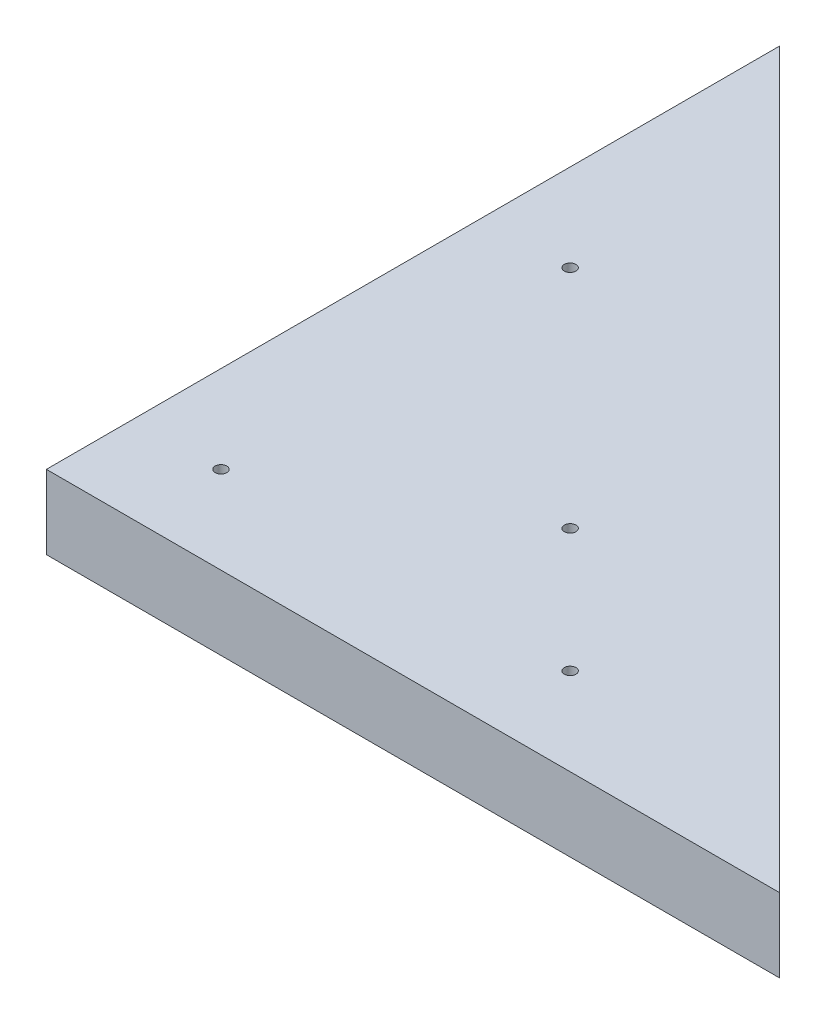
ISO-10303-21;
HEADER;
FILE_DESCRIPTION(('STEP AP214'),'2;1');
FILE_NAME('part.step','',(''),(''),'','','');
FILE_SCHEMA(('AUTOMOTIVE_DESIGN { 1 0 10303 214 1 1 1 1 }'));
ENDSEC;
DATA;
#1=APPLICATION_CONTEXT('core data for automotive mechanical design processes');
#2=APPLICATION_PROTOCOL_DEFINITION('international standard','automotive_design',2000,#1);
#3=PRODUCT_CONTEXT('',#1,'mechanical');
#4=PRODUCT('Part','Part','',(#3));
#5=PRODUCT_RELATED_PRODUCT_CATEGORY('part','',(#4));
#6=PRODUCT_DEFINITION_FORMATION('','',#4);
#7=PRODUCT_DEFINITION_CONTEXT('part definition',#1,'design');
#8=PRODUCT_DEFINITION('design','',#6,#7);
#9=PRODUCT_DEFINITION_SHAPE('','',#8);
#10=(LENGTH_UNIT() NAMED_UNIT(*) SI_UNIT(.MILLI.,.METRE.));
#11=(NAMED_UNIT(*) PLANE_ANGLE_UNIT() SI_UNIT($,.RADIAN.));
#12=(NAMED_UNIT(*) SI_UNIT($,.STERADIAN.) SOLID_ANGLE_UNIT());
#13=UNCERTAINTY_MEASURE_WITH_UNIT(LENGTH_MEASURE(1.E-05),#10,'distance_accuracy_value','');
#14=(GEOMETRIC_REPRESENTATION_CONTEXT(3) GLOBAL_UNCERTAINTY_ASSIGNED_CONTEXT((#13)) GLOBAL_UNIT_ASSIGNED_CONTEXT((#10,
#11,#12)) REPRESENTATION_CONTEXT('',''));
#15=CARTESIAN_POINT('',(0.,0.,0.));
#16=DIRECTION('',(0.,0.,1.));
#17=DIRECTION('',(1.,0.,0.));
#18=AXIS2_PLACEMENT_3D('',#15,#16,#17);
#19=CARTESIAN_POINT('',(8.78679656440357,190.89090885901,8.78679656440358));
#20=DIRECTION('',(0.,-1.,0.));
#21=DIRECTION('',(0.,0.,-1.));
#22=AXIS2_PLACEMENT_3D('',#19,#20,#21);
#23=CYLINDRICAL_SURFACE('',#22,1.);
#24=CARTESIAN_POINT('',(8.78679656440357,0.,8.78679656440358));
#25=DIRECTION('',(0.,1.,0.));
#26=DIRECTION('',(0.,0.,1.));
#27=AXIS2_PLACEMENT_3D('',#24,#25,#26);
#28=CIRCLE('',#27,1.);
#29=CARTESIAN_POINT('',(8.78679656440357,0.,9.78679656440358));
#30=VERTEX_POINT('',#29);
#31=EDGE_CURVE('E95',#30,#30,#28,.T.);
#32=ORIENTED_EDGE('',*,*,#31,.F.);
#33=EDGE_LOOP('',(#32));
#34=FACE_BOUND('',#33,.T.);
#35=CARTESIAN_POINT('',(8.78679656440357,12.7,8.78679656440358));
#36=DIRECTION('',(0.,1.,0.));
#37=DIRECTION('',(0.,0.,1.));
#38=AXIS2_PLACEMENT_3D('',#35,#36,#37);
#39=CIRCLE('',#38,1.);
#40=CARTESIAN_POINT('',(8.78679656440357,12.7,9.78679656440358));
#41=VERTEX_POINT('',#40);
#42=EDGE_CURVE('E86',#41,#41,#39,.T.);
#43=ORIENTED_EDGE('',*,*,#42,.T.);
#44=EDGE_LOOP('',(#43));
#45=FACE_BOUND('',#44,.T.);
#46=ADVANCED_FACE('F33',(#34,#45),#23,.F.);
#47=CARTESIAN_POINT('',(-45.,190.89090885901,45.));
#48=DIRECTION('',(0.,0.,-1.));
#49=DIRECTION('',(-1.,0.,0.));
#50=AXIS2_PLACEMENT_3D('',#47,#48,#49);
#51=PLANE('',#50);
#52=DIRECTION('',(1.,0.,0.));
#53=VECTOR('',#52,1.);
#54=CARTESIAN_POINT('',(-45.,12.7,45.));
#55=LINE('',#54,#53);
#56=CARTESIAN_POINT('',(-45.,12.7,45.));
#57=VERTEX_POINT('',#56);
#58=CARTESIAN_POINT('',(81.,12.7,45.));
#59=VERTEX_POINT('',#58);
#60=EDGE_CURVE('E69',#57,#59,#55,.T.);
#61=ORIENTED_EDGE('',*,*,#60,.F.);
#62=DIRECTION('',(0.,-1.,0.));
#63=VECTOR('',#62,1.);
#64=CARTESIAN_POINT('',(-45.,190.89090885901,45.));
#65=LINE('',#64,#63);
#66=CARTESIAN_POINT('',(-45.,0.,45.));
#67=VERTEX_POINT('',#66);
#68=EDGE_CURVE('E42',#57,#67,#65,.T.);
#69=ORIENTED_EDGE('',*,*,#68,.T.);
#70=DIRECTION('',(1.,0.,0.));
#71=VECTOR('',#70,1.);
#72=CARTESIAN_POINT('',(-45.,0.,45.));
#73=LINE('',#72,#71);
#74=CARTESIAN_POINT('',(81.,0.,45.));
#75=VERTEX_POINT('',#74);
#76=EDGE_CURVE('E71',#67,#75,#73,.T.);
#77=ORIENTED_EDGE('',*,*,#76,.T.);
#78=DIRECTION('',(0.,-1.,0.));
#79=VECTOR('',#78,1.);
#80=CARTESIAN_POINT('',(81.,190.89090885901,45.));
#81=LINE('',#80,#79);
#82=EDGE_CURVE('E65',#59,#75,#81,.T.);
#83=ORIENTED_EDGE('',*,*,#82,.F.);
#84=EDGE_LOOP('',(#61,#69,#77,#83));
#85=FACE_BOUND('',#84,.T.);
#86=ADVANCED_FACE('F67',(#85),#51,.F.);
#87=CARTESIAN_POINT('',(-45.,190.89090885901,-81.));
#88=DIRECTION('',(1.,0.,0.));
#89=DIRECTION('',(0.,0.,-1.));
#90=AXIS2_PLACEMENT_3D('',#87,#88,#89);
#91=PLANE('',#90);
#92=DIRECTION('',(0.,0.,1.));
#93=VECTOR('',#92,1.);
#94=CARTESIAN_POINT('',(-45.,12.7,-81.));
#95=LINE('',#94,#93);
#96=CARTESIAN_POINT('',(-45.,12.7,-81.));
#97=VERTEX_POINT('',#96);
#98=EDGE_CURVE('E52',#97,#57,#95,.T.);
#99=ORIENTED_EDGE('',*,*,#98,.F.);
#100=DIRECTION('',(0.,-1.,0.));
#101=VECTOR('',#100,1.);
#102=CARTESIAN_POINT('',(-45.,190.89090885901,-81.));
#103=LINE('',#102,#101);
#104=CARTESIAN_POINT('',(-45.,0.,-81.));
#105=VERTEX_POINT('',#104);
#106=EDGE_CURVE('E11',#97,#105,#103,.T.);
#107=ORIENTED_EDGE('',*,*,#106,.T.);
#108=DIRECTION('',(0.,0.,1.));
#109=VECTOR('',#108,1.);
#110=CARTESIAN_POINT('',(-45.,0.,-81.));
#111=LINE('',#110,#109);
#112=EDGE_CURVE('E103',#105,#67,#111,.T.);
#113=ORIENTED_EDGE('',*,*,#112,.T.);
#114=ORIENTED_EDGE('',*,*,#68,.F.);
#115=EDGE_LOOP('',(#99,#107,#113,#114));
#116=FACE_BOUND('',#115,.T.);
#117=ADVANCED_FACE('F107',(#116),#91,.F.);
#118=CARTESIAN_POINT('',(81.,190.89090885901,45.));
#119=DIRECTION('',(-0.707106781186548,0.,0.707106781186548));
#120=DIRECTION('',(0.707106781186548,0.,0.707106781186548));
#121=AXIS2_PLACEMENT_3D('',#118,#119,#120);
#122=PLANE('',#121);
#123=DIRECTION('',(-0.707106781186548,0.,-0.707106781186548));
#124=VECTOR('',#123,1.);
#125=CARTESIAN_POINT('',(81.,12.7,45.));
#126=LINE('',#125,#124);
#127=EDGE_CURVE('E77',#59,#97,#126,.T.);
#128=ORIENTED_EDGE('',*,*,#127,.F.);
#129=ORIENTED_EDGE('',*,*,#82,.T.);
#130=DIRECTION('',(-0.707106781186547,0.,-0.707106781186547));
#131=VECTOR('',#130,1.);
#132=CARTESIAN_POINT('',(81.,0.,45.));
#133=LINE('',#132,#131);
#134=EDGE_CURVE('E101',#75,#105,#133,.T.);
#135=ORIENTED_EDGE('',*,*,#134,.T.);
#136=ORIENTED_EDGE('',*,*,#106,.F.);
#137=EDGE_LOOP('',(#128,#129,#135,#136));
#138=FACE_BOUND('',#137,.T.);
#139=ADVANCED_FACE('F35',(#138),#122,.F.);
#140=CARTESIAN_POINT('',(30.,190.89090885901,30.));
#141=DIRECTION('',(0.,-1.,0.));
#142=DIRECTION('',(0.,0.,-1.));
#143=AXIS2_PLACEMENT_3D('',#140,#141,#142);
#144=CYLINDRICAL_SURFACE('',#143,0.999999999999998);
#145=CARTESIAN_POINT('',(30.,0.,30.));
#146=DIRECTION('',(0.,1.,0.));
#147=DIRECTION('',(0.,0.,1.));
#148=AXIS2_PLACEMENT_3D('',#145,#146,#147);
#149=CIRCLE('',#148,0.999999999999998);
#150=CARTESIAN_POINT('',(30.,0.,31.));
#151=VERTEX_POINT('',#150);
#152=EDGE_CURVE('E98',#151,#151,#149,.T.);
#153=ORIENTED_EDGE('',*,*,#152,.F.);
#154=EDGE_LOOP('',(#153));
#155=FACE_BOUND('',#154,.T.);
#156=CARTESIAN_POINT('',(30.,12.7,30.));
#157=DIRECTION('',(0.,1.,0.));
#158=DIRECTION('',(0.,0.,1.));
#159=AXIS2_PLACEMENT_3D('',#156,#157,#158);
#160=CIRCLE('',#159,0.999999999999998);
#161=CARTESIAN_POINT('',(30.,12.7,31.));
#162=VERTEX_POINT('',#161);
#163=EDGE_CURVE('E82',#162,#162,#160,.T.);
#164=ORIENTED_EDGE('',*,*,#163,.T.);
#165=EDGE_LOOP('',(#164));
#166=FACE_BOUND('',#165,.T.);
#167=ADVANCED_FACE('F140',(#155,#166),#144,.F.);
#168=CARTESIAN_POINT('',(-30.,190.89090885901,-30.));
#169=DIRECTION('',(0.,-1.,0.));
#170=DIRECTION('',(0.,0.,-1.));
#171=AXIS2_PLACEMENT_3D('',#168,#169,#170);
#172=CYLINDRICAL_SURFACE('',#171,0.999999999999998);
#173=CARTESIAN_POINT('',(-30.,0.,-30.));
#174=DIRECTION('',(0.,1.,0.));
#175=DIRECTION('',(0.,0.,1.));
#176=AXIS2_PLACEMENT_3D('',#173,#174,#175);
#177=CIRCLE('',#176,0.999999999999998);
#178=CARTESIAN_POINT('',(-30.,0.,-29.));
#179=VERTEX_POINT('',#178);
#180=EDGE_CURVE('E92',#179,#179,#177,.T.);
#181=ORIENTED_EDGE('',*,*,#180,.F.);
#182=EDGE_LOOP('',(#181));
#183=FACE_BOUND('',#182,.T.);
#184=CARTESIAN_POINT('',(-30.,12.7,-30.));
#185=DIRECTION('',(0.,1.,0.));
#186=DIRECTION('',(0.,0.,1.));
#187=AXIS2_PLACEMENT_3D('',#184,#185,#186);
#188=CIRCLE('',#187,0.999999999999998);
#189=CARTESIAN_POINT('',(-30.,12.7,-29.));
#190=VERTEX_POINT('',#189);
#191=EDGE_CURVE('E126',#190,#190,#188,.T.);
#192=ORIENTED_EDGE('',*,*,#191,.T.);
#193=EDGE_LOOP('',(#192));
#194=FACE_BOUND('',#193,.T.);
#195=ADVANCED_FACE('F113',(#183,#194),#172,.F.);
#196=CARTESIAN_POINT('',(0.,0.,0.));
#197=DIRECTION('',(0.,1.,0.));
#198=DIRECTION('',(0.,0.,1.));
#199=AXIS2_PLACEMENT_3D('',#196,#197,#198);
#200=PLANE('',#199);
#201=ORIENTED_EDGE('',*,*,#180,.T.);
#202=EDGE_LOOP('',(#201));
#203=FACE_BOUND('',#202,.T.);
#204=ORIENTED_EDGE('',*,*,#152,.T.);
#205=EDGE_LOOP('',(#204));
#206=FACE_BOUND('',#205,.T.);
#207=ORIENTED_EDGE('',*,*,#134,.F.);
#208=ORIENTED_EDGE('',*,*,#76,.F.);
#209=ORIENTED_EDGE('',*,*,#112,.F.);
#210=EDGE_LOOP('',(#207,#208,#209));
#211=FACE_BOUND('',#210,.T.);
#212=ORIENTED_EDGE('',*,*,#31,.T.);
#213=EDGE_LOOP('',(#212));
#214=FACE_BOUND('',#213,.T.);
#215=CARTESIAN_POINT('',(-30.,0.,30.));
#216=DIRECTION('',(0.,1.,0.));
#217=DIRECTION('',(0.,0.,1.));
#218=AXIS2_PLACEMENT_3D('',#215,#216,#217);
#219=CIRCLE('',#218,0.999999999999998);
#220=CARTESIAN_POINT('',(-30.,0.,31.));
#221=VERTEX_POINT('',#220);
#222=EDGE_CURVE('E79',#221,#221,#219,.T.);
#223=ORIENTED_EDGE('',*,*,#222,.T.);
#224=EDGE_LOOP('',(#223));
#225=FACE_BOUND('',#224,.T.);
#226=ADVANCED_FACE('F109',(#203,#206,#211,#214,#225),#200,.F.);
#227=CARTESIAN_POINT('',(-30.,190.89090885901,30.));
#228=DIRECTION('',(0.,-1.,0.));
#229=DIRECTION('',(0.,0.,-1.));
#230=AXIS2_PLACEMENT_3D('',#227,#228,#229);
#231=CYLINDRICAL_SURFACE('',#230,0.999999999999998);
#232=ORIENTED_EDGE('',*,*,#222,.F.);
#233=EDGE_LOOP('',(#232));
#234=FACE_BOUND('',#233,.T.);
#235=CARTESIAN_POINT('',(-30.,12.7,30.));
#236=DIRECTION('',(0.,1.,0.));
#237=DIRECTION('',(0.,0.,1.));
#238=AXIS2_PLACEMENT_3D('',#235,#236,#237);
#239=CIRCLE('',#238,0.999999999999998);
#240=CARTESIAN_POINT('',(-30.,12.7,31.));
#241=VERTEX_POINT('',#240);
#242=EDGE_CURVE('E37',#241,#241,#239,.T.);
#243=ORIENTED_EDGE('',*,*,#242,.T.);
#244=EDGE_LOOP('',(#243));
#245=FACE_BOUND('',#244,.T.);
#246=ADVANCED_FACE('F112',(#234,#245),#231,.F.);
#247=CARTESIAN_POINT('',(0.,12.7,0.));
#248=DIRECTION('',(0.,1.,0.));
#249=DIRECTION('',(0.,0.,1.));
#250=AXIS2_PLACEMENT_3D('',#247,#248,#249);
#251=PLANE('',#250);
#252=ORIENTED_EDGE('',*,*,#242,.F.);
#253=EDGE_LOOP('',(#252));
#254=FACE_BOUND('',#253,.T.);
#255=ORIENTED_EDGE('',*,*,#191,.F.);
#256=EDGE_LOOP('',(#255));
#257=FACE_BOUND('',#256,.T.);
#258=ORIENTED_EDGE('',*,*,#42,.F.);
#259=EDGE_LOOP('',(#258));
#260=FACE_BOUND('',#259,.T.);
#261=ORIENTED_EDGE('',*,*,#163,.F.);
#262=EDGE_LOOP('',(#261));
#263=FACE_BOUND('',#262,.T.);
#264=ORIENTED_EDGE('',*,*,#60,.T.);
#265=ORIENTED_EDGE('',*,*,#127,.T.);
#266=ORIENTED_EDGE('',*,*,#98,.T.);
#267=EDGE_LOOP('',(#264,#265,#266));
#268=FACE_BOUND('',#267,.T.);
#269=ADVANCED_FACE('F81',(#254,#257,#260,#263,#268),#251,.T.);
#270=CLOSED_SHELL('',(#46,#86,#117,#139,#167,#195,#226,#246,#269));
#271=MANIFOLD_SOLID_BREP('B2',#270);
#272=ADVANCED_BREP_SHAPE_REPRESENTATION('',(#18,#271),#14);
#273=SHAPE_DEFINITION_REPRESENTATION(#9,#272);
ENDSEC;
END-ISO-10303-21;
